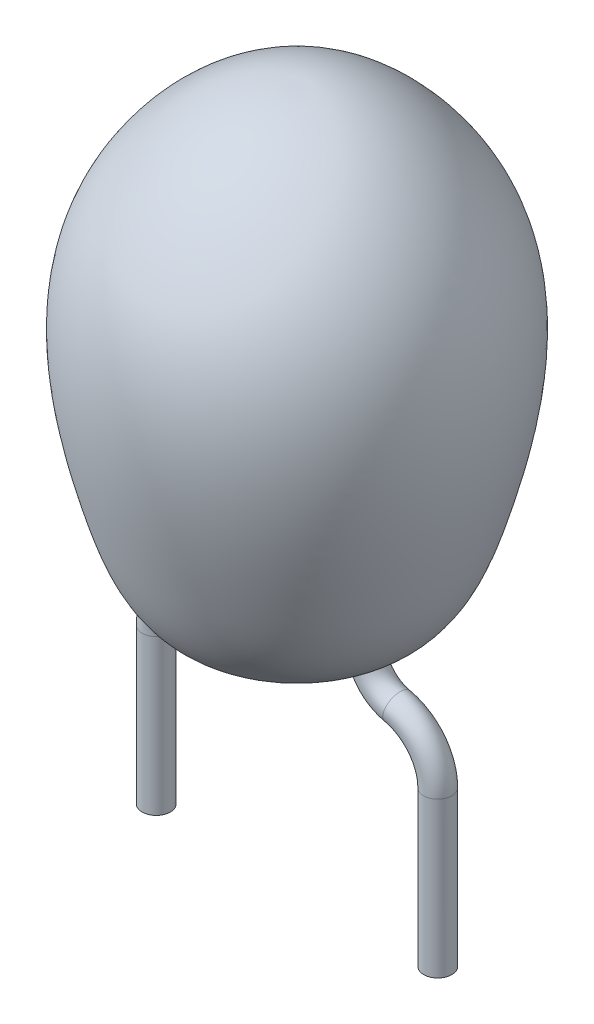
ISO-10303-21;
HEADER;
FILE_DESCRIPTION(('STEP AP214'),'2;1');
FILE_NAME('part.step','',(''),(''),'','','');
FILE_SCHEMA(('AUTOMOTIVE_DESIGN { 1 0 10303 214 1 1 1 1 }'));
ENDSEC;
DATA;
#1=APPLICATION_CONTEXT('core data for automotive mechanical design processes');
#2=APPLICATION_PROTOCOL_DEFINITION('international standard','automotive_design',2000,#1);
#3=PRODUCT_CONTEXT('',#1,'mechanical');
#4=PRODUCT('Part','Part','',(#3));
#5=PRODUCT_RELATED_PRODUCT_CATEGORY('part','',(#4));
#6=PRODUCT_DEFINITION_FORMATION('','',#4);
#7=PRODUCT_DEFINITION_CONTEXT('part definition',#1,'design');
#8=PRODUCT_DEFINITION('design','',#6,#7);
#9=PRODUCT_DEFINITION_SHAPE('','',#8);
#10=(LENGTH_UNIT() NAMED_UNIT(*) SI_UNIT(.MILLI.,.METRE.));
#11=(NAMED_UNIT(*) PLANE_ANGLE_UNIT() SI_UNIT($,.RADIAN.));
#12=(NAMED_UNIT(*) SI_UNIT($,.STERADIAN.) SOLID_ANGLE_UNIT());
#13=UNCERTAINTY_MEASURE_WITH_UNIT(LENGTH_MEASURE(1.E-05),#10,'distance_accuracy_value','');
#14=(GEOMETRIC_REPRESENTATION_CONTEXT(3) GLOBAL_UNCERTAINTY_ASSIGNED_CONTEXT((#13)) GLOBAL_UNIT_ASSIGNED_CONTEXT((#10,
#11,#12)) REPRESENTATION_CONTEXT('',''));
#15=CARTESIAN_POINT('',(0.,0.,0.));
#16=DIRECTION('',(0.,0.,1.));
#17=DIRECTION('',(1.,0.,0.));
#18=AXIS2_PLACEMENT_3D('',#15,#16,#17);
#19=CARTESIAN_POINT('',(2.54,9.97458,0.));
#20=CARTESIAN_POINT('',(2.47974289268972,9.97548804443726,0.));
#21=CARTESIAN_POINT('',(1.39414202398829,9.99184750598306,0.));
#22=CARTESIAN_POINT('',(-1.07872302145443,7.90433195628743,0.));
#23=CARTESIAN_POINT('',(-0.588026500609491,4.51641926353557,0.));
#24=CARTESIAN_POINT('',(0.343357672924847,1.87543708392526,0.));
#25=CARTESIAN_POINT('',(1.53263430059522,1.60072648135662,0.));
#26=CARTESIAN_POINT('',(2.10189668388165,1.50706063448639,0.));
#27=CARTESIAN_POINT('',(2.42633650086462,1.51396214180302,0.));
#28=CARTESIAN_POINT('',(2.53999999999999,1.51637999999999,0.));
#29=B_SPLINE_CURVE_WITH_KNOTS('',3,(#19,#20,#21,#22,#23,#24,#25,#26,#27,#28),.UNSPECIFIED.,.F.,
.F.,(4,1,1,1,1,1,1,4),(0.,0.0154835525893933,0.278953950694581,0.670997062934818,
0.850642039530875,0.916767159551499,0.970840398147402,1.),.UNSPECIFIED.);
#30=CARTESIAN_POINT('',(2.54,11.3856980965108,0.));
#31=DIRECTION('',(0.,1.,0.));
#32=AXIS1_PLACEMENT('',#30,#31);
#33=SURFACE_OF_REVOLUTION('',#29,#32);
#34=CARTESIAN_POINT('',(2.54,9.97458,0.));
#35=VERTEX_POINT('',#34);
#36=VERTEX_LOOP('',#35);
#37=FACE_BOUND('',#36,.T.);
#38=CARTESIAN_POINT('',(2.53999999999999,1.51637999999999,0.));
#39=VERTEX_POINT('',#38);
#40=VERTEX_LOOP('',#39);
#41=FACE_BOUND('',#40,.T.);
#42=CARTESIAN_POINT('',(1.02490235793972,1.74427323908224,0.));
#43=CARTESIAN_POINT('',(1.02490336605588,1.74427289682011,0.0157509381594712));
#44=CARTESIAN_POINT('',(1.0263088078459,1.7438335086506,0.0315052185537073));
#45=CARTESIAN_POINT('',(1.03187237871885,1.74210313979935,0.0624814848905003));
#46=CARTESIAN_POINT('',(1.03603506231303,1.74081075011157,0.0777025461679323));
#47=CARTESIAN_POINT('',(1.05145704219399,1.73606082239147,0.118948011210185));
#48=CARTESIAN_POINT('',(1.06573119812459,1.73169792466758,0.143818882566274));
#49=CARTESIAN_POINT('',(1.10140475122235,1.72106753688358,0.18718027920339));
#50=CARTESIAN_POINT('',(1.1228069129587,1.7147993079307,0.205668323254875));
#51=CARTESIAN_POINT('',(1.17038004895996,1.70126002416138,0.2342275726217));
#52=CARTESIAN_POINT('',(1.1965493616108,1.69398931897698,0.244301703836336));
#53=CARTESIAN_POINT('',(1.25070949858774,1.67933217249043,0.254889655679845));
#54=CARTESIAN_POINT('',(1.27869951340179,1.67194578371714,0.255407696328447));
#55=CARTESIAN_POINT('',(1.33334692356719,1.65778980272431,0.246838769642436));
#56=CARTESIAN_POINT('',(1.36000376858664,1.6510204642897,0.237747869462107));
#57=CARTESIAN_POINT('',(1.40893779554417,1.63868744592926,0.210988586144352));
#58=CARTESIAN_POINT('',(1.43121227387594,1.63312451005235,0.193314931232676));
#59=CARTESIAN_POINT('',(1.46883021304784,1.62371272520938,0.151302596663081));
#60=CARTESIAN_POINT('',(1.48417427243034,1.6198637282202,0.126964492868868));
#61=CARTESIAN_POINT('',(1.50067162703187,1.61570887956735,0.0876796181848498));
#62=CARTESIAN_POINT('',(1.50508647584367,1.61459312383659,0.0740927104931887));
#63=CARTESIAN_POINT('',(1.51164495179295,1.61293368340425,0.0463532159842585));
#64=CARTESIAN_POINT('',(1.51379174144137,1.61238920214269,0.03220144546416));
#65=CARTESIAN_POINT('',(1.51575195318497,1.61189209160177,0.00371183126286482));
#66=CARTESIAN_POINT('',(1.51556233968319,1.61194023229277,-0.0106262303070209));
#67=CARTESIAN_POINT('',(1.51285349837205,1.61262709415498,-0.0390466648696262));
#68=CARTESIAN_POINT('',(1.51033752345638,1.61326499068502,-0.0531293668967632));
#69=CARTESIAN_POINT('',(1.50304447447703,1.61510896742615,-0.0806788767977936));
#70=CARTESIAN_POINT('',(1.49826423498684,1.61631584305504,-0.094144793416661));
#71=CARTESIAN_POINT('',(1.48658444070797,1.61925590959071,-0.120038819068053));
#72=CARTESIAN_POINT('',(1.47968785179127,1.6209883639081,-0.132468349695622));
#73=CARTESIAN_POINT('',(1.46395700468115,1.62493161925125,-0.155974962239724));
#74=CARTESIAN_POINT('',(1.45512003720871,1.62714308904967,-0.167050119091328));
#75=CARTESIAN_POINT('',(1.43578036589726,1.6319813204454,-0.187498749447525));
#76=CARTESIAN_POINT('',(1.42527999802857,1.63460749963598,-0.196874570375981));
#77=CARTESIAN_POINT('',(1.40288691638226,1.64022014700092,-0.21369242706117));
#78=CARTESIAN_POINT('',(1.3909919242103,1.64320720499141,-0.221131232637591));
#79=CARTESIAN_POINT('',(1.36618402838374,1.64946764268679,-0.233834762570047));
#80=CARTESIAN_POINT('',(1.35327256734075,1.65274061730657,-0.239102504222151));
#81=CARTESIAN_POINT('',(1.32676524023766,1.65951108089259,-0.247337021269825));
#82=CARTESIAN_POINT('',(1.3131682229366,1.66300895042688,-0.250299778968753));
#83=CARTESIAN_POINT('',(1.28572172315192,1.67013940947337,-0.25382213358671));
#84=CARTESIAN_POINT('',(1.27187262103764,1.67377180338849,-0.254385091332288));
#85=CARTESIAN_POINT('',(1.2442850186388,1.68109094932935,-0.253099862323733));
#86=CARTESIAN_POINT('',(1.23054665395539,1.68477775582421,-0.25124907091839));
#87=CARTESIAN_POINT('',(1.20360732880656,1.69209723825854,-0.245188198550053));
#88=CARTESIAN_POINT('',(1.19040564309993,1.69572998273731,-0.24098142328405));
#89=CARTESIAN_POINT('',(1.16488356878557,1.70284152783675,-0.230326103310917));
#90=CARTESIAN_POINT('',(1.15256382907432,1.70632021440521,-0.223875928041898));
#91=CARTESIAN_POINT('',(1.12917898351456,1.71300294654217,-0.20892828498787));
#92=CARTESIAN_POINT('',(1.11811215485272,1.71620736772134,-0.200433679929219));
#93=CARTESIAN_POINT('',(1.09750530924031,1.72223873595844,-0.181619377393251));
#94=CARTESIAN_POINT('',(1.08796754875771,1.72506512414749,-0.171297029078038));
#95=CARTESIAN_POINT('',(1.07071360874071,1.73022446861118,-0.149144496898906));
#96=CARTESIAN_POINT('',(1.06299491454275,1.73255810559125,-0.137316429806621));
#97=CARTESIAN_POINT('',(1.0495587494987,1.73664812199407,-0.112450159823206));
#98=CARTESIAN_POINT('',(1.04384540629867,1.73840331033889,-0.0994095300325753));
#99=CARTESIAN_POINT('',(1.03460546580502,1.74125410618617,-0.0725308699684236));
#100=CARTESIAN_POINT('',(1.03107545759152,1.74235074243473,-0.0586941205925307));
#101=CARTESIAN_POINT('',(1.02616761482125,1.74387775331988,-0.029919878701252));
#102=CARTESIAN_POINT('',(1.02490140035379,1.74427356418902,-0.0149614471421896));
#103=CARTESIAN_POINT('',(1.02490235793972,1.74427323908224,0.));
#104=B_SPLINE_CURVE_WITH_KNOTS('',3,(#42,#43,#44,#45,#46,#47,#48,#49,#50,#51,#52,#53,#54,#55,
#56,#57,#58,#59,#60,#61,#62,#63,#64,#65,#66,#67,#68,#69,#70,#71,#72,#73,#74,#75,#76,#77,#78,#79,
#80,#81,#82,#83,#84,#85,#86,#87,#88,#89,#90,#91,#92,#93,#94,#95,#96,#97,#98,#99,#100,#101,#102,
#103),.UNSPECIFIED.,.T.,.F.,(4,2,2,2,2,2,2,2,2,2,2,2,2,2,2,2,2,2,2,2,2,2,2,2,2,2,2,2,2,2,4),(0.,
0.0471846793615346,0.0944474950975439,0.179710590268481,0.265006792982135,0.350273321971121,
0.435502195911697,0.520765966711329,0.606082175333539,0.691391014252125,0.734211456477834,
0.77697211209238,0.819788330800927,0.862544771038316,0.905361161703,0.948117820999726,
0.990934563828189,1.03369170214827,1.07651969243187,1.11928795897296,1.16213060664811,
1.20491323510845,1.24774206807182,1.29051095762222,1.33331099790834,1.37605145231299,
1.41885441010703,1.46159784570436,1.50442875185921,1.54719257519853,1.59201219667385),.UNSPECIFIED.);
#105=CARTESIAN_POINT('',(1.02490235793972,1.74427323908224,0.));
#106=VERTEX_POINT('',#105);
#107=EDGE_CURVE('E11',#106,#106,#104,.T.);
#108=ORIENTED_EDGE('',*,*,#107,.T.);
#109=EDGE_LOOP('',(#108));
#110=FACE_BOUND('',#109,.T.);
#111=CARTESIAN_POINT('',(4.05509764206028,1.74427323908224,0.));
#112=CARTESIAN_POINT('',(4.05509663394412,1.74427289682011,-0.0157509381594712));
#113=CARTESIAN_POINT('',(4.0536911921541,1.7438335086506,-0.0315052185537073));
#114=CARTESIAN_POINT('',(4.04812762128115,1.74210313979935,-0.0624814848905002));
#115=CARTESIAN_POINT('',(4.04396493768697,1.74081075011157,-0.077702546167932));
#116=CARTESIAN_POINT('',(4.028542957806,1.73606082239147,-0.118948011210185));
#117=CARTESIAN_POINT('',(4.01426880187541,1.73169792466758,-0.143818882566274));
#118=CARTESIAN_POINT('',(3.97859524877765,1.72106753688358,-0.187180279203389));
#119=CARTESIAN_POINT('',(3.95719308704129,1.7147993079307,-0.205668323254874));
#120=CARTESIAN_POINT('',(3.90961995104004,1.70126002416138,-0.2342275726217));
#121=CARTESIAN_POINT('',(3.8834506383892,1.69398931897698,-0.244301703836337));
#122=CARTESIAN_POINT('',(3.82929050141226,1.67933217249043,-0.254889655679845));
#123=CARTESIAN_POINT('',(3.80130048659821,1.67194578371714,-0.255407696328446));
#124=CARTESIAN_POINT('',(3.74665307643281,1.65778980272431,-0.246838769642435));
#125=CARTESIAN_POINT('',(3.71999623141336,1.6510204642897,-0.237747869462107));
#126=CARTESIAN_POINT('',(3.67106220445583,1.63868744592926,-0.210988586144351));
#127=CARTESIAN_POINT('',(3.64878772612406,1.63312451005235,-0.193314931232676));
#128=CARTESIAN_POINT('',(3.61116978695216,1.62371272520938,-0.151302596663081));
#129=CARTESIAN_POINT('',(3.59582572756966,1.6198637282202,-0.126964492868868));
#130=CARTESIAN_POINT('',(3.57932837296813,1.61570887956735,-0.0876796181848498));
#131=CARTESIAN_POINT('',(3.57491352415633,1.61459312383659,-0.0740927104931889));
#132=CARTESIAN_POINT('',(3.56835504820705,1.61293368340425,-0.0463532159842587));
#133=CARTESIAN_POINT('',(3.56620825855863,1.61238920214269,-0.0322014454641599));
#134=CARTESIAN_POINT('',(3.56424804681503,1.61189209160177,-0.00371183126286455));
#135=CARTESIAN_POINT('',(3.56443766031681,1.61194023229277,0.0106262303070213));
#136=CARTESIAN_POINT('',(3.56714650162795,1.61262709415498,0.0390466648696266));
#137=CARTESIAN_POINT('',(3.56966247654362,1.61326499068502,0.0531293668967635));
#138=CARTESIAN_POINT('',(3.57695552552297,1.61510896742615,0.0806788767977938));
#139=CARTESIAN_POINT('',(3.58173576501316,1.61631584305504,0.0941447934166612));
#140=CARTESIAN_POINT('',(3.59341555929203,1.61925590959071,0.120038819068053));
#141=CARTESIAN_POINT('',(3.60031214820873,1.6209883639081,0.132468349695622));
#142=CARTESIAN_POINT('',(3.61604299531885,1.62493161925125,0.155974962239724));
#143=CARTESIAN_POINT('',(3.62487996279129,1.62714308904967,0.167050119091328));
#144=CARTESIAN_POINT('',(3.64421963410274,1.6319813204454,0.187498749447525));
#145=CARTESIAN_POINT('',(3.65472000197143,1.63460749963598,0.196874570375981));
#146=CARTESIAN_POINT('',(3.67711308361774,1.64022014700093,0.21369242706117));
#147=CARTESIAN_POINT('',(3.6890080757897,1.64320720499141,0.221131232637591));
#148=CARTESIAN_POINT('',(3.71381597161626,1.64946764268679,0.233834762570048));
#149=CARTESIAN_POINT('',(3.72672743265925,1.65274061730657,0.239102504222152));
#150=CARTESIAN_POINT('',(3.75323475976234,1.65951108089259,0.247337021269825));
#151=CARTESIAN_POINT('',(3.7668317770634,1.66300895042688,0.250299778968753));
#152=CARTESIAN_POINT('',(3.79427827684808,1.67013940947337,0.25382213358671));
#153=CARTESIAN_POINT('',(3.80812737896236,1.67377180338849,0.254385091332289));
#154=CARTESIAN_POINT('',(3.8357149813612,1.68109094932935,0.253099862323733));
#155=CARTESIAN_POINT('',(3.84945334604461,1.68477775582421,0.25124907091839));
#156=CARTESIAN_POINT('',(3.87639267119344,1.69209723825854,0.245188198550053));
#157=CARTESIAN_POINT('',(3.88959435690007,1.69572998273731,0.240981423284051));
#158=CARTESIAN_POINT('',(3.91511643121442,1.70284152783675,0.230326103310918));
#159=CARTESIAN_POINT('',(3.92743617092568,1.70632021440521,0.223875928041898));
#160=CARTESIAN_POINT('',(3.95082101648544,1.71300294654217,0.20892828498787));
#161=CARTESIAN_POINT('',(3.96188784514728,1.71620736772134,0.20043367992922));
#162=CARTESIAN_POINT('',(3.98249469075969,1.72223873595844,0.181619377393252));
#163=CARTESIAN_POINT('',(3.99203245124229,1.72506512414749,0.171297029078037));
#164=CARTESIAN_POINT('',(4.00928639125929,1.73022446861118,0.149144496898906));
#165=CARTESIAN_POINT('',(4.01700508545725,1.73255810559125,0.137316429806622));
#166=CARTESIAN_POINT('',(4.0304412505013,1.73664812199407,0.112450159823207));
#167=CARTESIAN_POINT('',(4.03615459370133,1.73840331033889,0.0994095300325756));
#168=CARTESIAN_POINT('',(4.04539453419498,1.74125410618616,0.0725308699684235));
#169=CARTESIAN_POINT('',(4.04892454240848,1.74235074243473,0.0586941205925306));
#170=CARTESIAN_POINT('',(4.05383238517875,1.74387775331988,0.0299198787012521));
#171=CARTESIAN_POINT('',(4.05509859964621,1.74427356418902,0.0149614471421896));
#172=CARTESIAN_POINT('',(4.05509764206028,1.74427323908224,0.));
#173=B_SPLINE_CURVE_WITH_KNOTS('',3,(#111,#112,#113,#114,#115,#116,#117,#118,#119,#120,#121,
#122,#123,#124,#125,#126,#127,#128,#129,#130,#131,#132,#133,#134,#135,#136,#137,#138,#139,#140,
#141,#142,#143,#144,#145,#146,#147,#148,#149,#150,#151,#152,#153,#154,#155,#156,#157,#158,#159,
#160,#161,#162,#163,#164,#165,#166,#167,#168,#169,#170,#171,#172),.UNSPECIFIED.,.T.,.F.,(4,2,2,
2,2,2,2,2,2,2,2,2,2,2,2,2,2,2,2,2,2,2,2,2,2,2,2,2,2,2,4),(0.,0.0471846793615345,
0.0944474950975441,0.179710590268481,0.265006792982134,0.35027332197112,0.435502195911697,
0.520765966711328,0.606082175333539,0.691391014252125,0.734211456477833,0.776972112092379,
0.819788330800926,0.862544771038315,0.905361161702999,0.948117820999725,0.990934563828189,
1.03369170214827,1.07651969243187,1.11928795897296,1.16213060664811,1.20491323510845,
1.24774206807182,1.29051095762222,1.33331099790833,1.37605145231299,1.41885441010703,
1.46159784570436,1.50442875185921,1.54719257519853,1.59201219667385),.UNSPECIFIED.);
#174=CARTESIAN_POINT('',(4.05509764206028,1.74427323908224,0.));
#175=VERTEX_POINT('',#174);
#176=EDGE_CURVE('E36',#175,#175,#173,.T.);
#177=ORIENTED_EDGE('',*,*,#176,.T.);
#178=EDGE_LOOP('',(#177));
#179=FACE_BOUND('',#178,.T.);
#180=ADVANCED_FACE('F31',(#37,#41,#110,#179),#33,.F.);
#181=CARTESIAN_POINT('',(0.57783422143837,1.869694,0.));
#182=DIRECTION('',(0.,0.,1.));
#183=DIRECTION('',(1.,0.,0.));
#184=AXIS2_PLACEMENT_3D('',#181,#182,#183);
#185=TOROIDAL_SURFACE('',#184,0.71832777856163,0.254);
#186=ORIENTED_EDGE('',*,*,#107,.F.);
#187=EDGE_LOOP('',(#186));
#188=FACE_BOUND('',#187,.T.);
#189=CARTESIAN_POINT('',(0.733609558615477,1.16846020034353,0.));
#190=DIRECTION('',(0.976203093608056,0.21685829481498,0.));
#191=DIRECTION('',(0.,0.,1.));
#192=AXIS2_PLACEMENT_3D('',#189,#190,#191);
#193=CIRCLE('',#192,0.254);
#194=CARTESIAN_POINT('',(0.678527551732473,1.41641578611998,0.));
#195=VERTEX_POINT('',#194);
#196=EDGE_CURVE('E45',#195,#195,#193,.T.);
#197=ORIENTED_EDGE('',*,*,#196,.T.);
#198=EDGE_LOOP('',(#197));
#199=FACE_BOUND('',#198,.T.);
#200=ADVANCED_FACE('F33',(#188,#199),#185,.T.);
#201=CARTESIAN_POINT('',(0.936752,0.254,0.));
#202=DIRECTION('',(0.,0.,-1.));
#203=DIRECTION('',(-1.,0.,0.));
#204=AXIS2_PLACEMENT_3D('',#201,#202,#203);
#205=TOROIDAL_SURFACE('',#204,0.936752,0.254);
#206=CARTESIAN_POINT('',(0.,0.254,0.));
#207=DIRECTION('',(0.,1.,0.));
#208=DIRECTION('',(0.,0.,1.));
#209=AXIS2_PLACEMENT_3D('',#206,#207,#208);
#210=CIRCLE('',#209,0.254);
#211=CARTESIAN_POINT('',(-0.254,0.254,0.));
#212=VERTEX_POINT('',#211);
#213=EDGE_CURVE('E61',#212,#212,#210,.T.);
#214=CARTESIAN_POINT('',(0.936752,0.254,0.));
#215=DIRECTION('',(0.,0.,-1.));
#216=DIRECTION('',(-1.,0.,0.));
#217=AXIS2_PLACEMENT_3D('',#214,#215,#216);
#218=CIRCLE('',#217,1.190752);
#219=EDGE_CURVE('',#212,#195,#218,.T.);
#220=ORIENTED_EDGE('',*,*,#213,.T.);
#221=ORIENTED_EDGE('',*,*,#196,.F.);
#222=ORIENTED_EDGE('',*,*,#219,.T.);
#223=ORIENTED_EDGE('',*,*,#219,.F.);
#224=EDGE_LOOP('',(#220,#222,#221,#223));
#225=FACE_BOUND('',#224,.T.);
#226=ADVANCED_FACE('F97',(#225),#205,.T.);
#227=CARTESIAN_POINT('',(0.,0.254,0.));
#228=DIRECTION('',(0.,-1.,0.));
#229=DIRECTION('',(1.,0.,0.));
#230=AXIS2_PLACEMENT_3D('',#227,#228,#229);
#231=CYLINDRICAL_SURFACE('',#230,0.254);
#232=ORIENTED_EDGE('',*,*,#213,.F.);
#233=EDGE_LOOP('',(#232));
#234=FACE_BOUND('',#233,.T.);
#235=CARTESIAN_POINT('',(0.,-2.54,0.));
#236=DIRECTION('',(0.,1.,0.));
#237=DIRECTION('',(0.,0.,1.));
#238=AXIS2_PLACEMENT_3D('',#235,#236,#237);
#239=CIRCLE('',#238,0.254);
#240=CARTESIAN_POINT('',(0.,-2.54,0.254));
#241=VERTEX_POINT('',#240);
#242=EDGE_CURVE('E58',#241,#241,#239,.T.);
#243=ORIENTED_EDGE('',*,*,#242,.T.);
#244=EDGE_LOOP('',(#243));
#245=FACE_BOUND('',#244,.T.);
#246=ADVANCED_FACE('F100',(#234,#245),#231,.T.);
#247=CARTESIAN_POINT('',(0.,-2.54,0.));
#248=DIRECTION('',(0.,1.,0.));
#249=DIRECTION('',(0.,0.,1.));
#250=AXIS2_PLACEMENT_3D('',#247,#248,#249);
#251=PLANE('',#250);
#252=ORIENTED_EDGE('',*,*,#242,.F.);
#253=EDGE_LOOP('',(#252));
#254=FACE_BOUND('',#253,.T.);
#255=ADVANCED_FACE('F85',(#254),#251,.F.);
#256=CARTESIAN_POINT('',(4.50216577856163,1.869694,0.));
#257=DIRECTION('',(0.,0.,-1.));
#258=DIRECTION('',(-1.,0.,0.));
#259=AXIS2_PLACEMENT_3D('',#256,#257,#258);
#260=TOROIDAL_SURFACE('',#259,0.71832777856163,0.254);
#261=ORIENTED_EDGE('',*,*,#176,.F.);
#262=EDGE_LOOP('',(#261));
#263=FACE_BOUND('',#262,.T.);
#264=CARTESIAN_POINT('',(4.34639044138452,1.16846020034353,0.));
#265=DIRECTION('',(0.976203093608056,-0.216858294814979,0.));
#266=DIRECTION('',(0.,0.,1.));
#267=AXIS2_PLACEMENT_3D('',#264,#265,#266);
#268=CIRCLE('',#267,0.254);
#269=CARTESIAN_POINT('',(4.40147244826753,1.41641578611998,0.));
#270=VERTEX_POINT('',#269);
#271=EDGE_CURVE('E59',#270,#270,#268,.T.);
#272=ORIENTED_EDGE('',*,*,#271,.F.);
#273=EDGE_LOOP('',(#272));
#274=FACE_BOUND('',#273,.T.);
#275=ADVANCED_FACE('F82',(#263,#274),#260,.T.);
#276=CARTESIAN_POINT('',(4.143248,0.254,0.));
#277=DIRECTION('',(0.,0.,1.));
#278=DIRECTION('',(1.,0.,0.));
#279=AXIS2_PLACEMENT_3D('',#276,#277,#278);
#280=TOROIDAL_SURFACE('',#279,0.936752,0.254);
#281=CARTESIAN_POINT('',(5.08,0.254,0.));
#282=DIRECTION('',(0.,-1.,0.));
#283=DIRECTION('',(0.,0.,1.));
#284=AXIS2_PLACEMENT_3D('',#281,#282,#283);
#285=CIRCLE('',#284,0.254);
#286=CARTESIAN_POINT('',(5.334,0.254,0.));
#287=VERTEX_POINT('',#286);
#288=EDGE_CURVE('E64',#287,#287,#285,.T.);
#289=CARTESIAN_POINT('',(4.143248,0.254,0.));
#290=DIRECTION('',(0.,0.,1.));
#291=DIRECTION('',(1.,0.,0.));
#292=AXIS2_PLACEMENT_3D('',#289,#290,#291);
#293=CIRCLE('',#292,1.190752);
#294=EDGE_CURVE('',#287,#270,#293,.T.);
#295=ORIENTED_EDGE('',*,*,#288,.F.);
#296=ORIENTED_EDGE('',*,*,#271,.T.);
#297=ORIENTED_EDGE('',*,*,#294,.T.);
#298=ORIENTED_EDGE('',*,*,#294,.F.);
#299=EDGE_LOOP('',(#295,#297,#296,#298));
#300=FACE_BOUND('',#299,.T.);
#301=ADVANCED_FACE('F109',(#300),#280,.T.);
#302=CARTESIAN_POINT('',(5.08,0.254,0.));
#303=DIRECTION('',(0.,-1.,0.));
#304=DIRECTION('',(0.,0.,-1.));
#305=AXIS2_PLACEMENT_3D('',#302,#303,#304);
#306=CYLINDRICAL_SURFACE('',#305,0.254);
#307=ORIENTED_EDGE('',*,*,#288,.T.);
#308=EDGE_LOOP('',(#307));
#309=FACE_BOUND('',#308,.T.);
#310=CARTESIAN_POINT('',(5.08,-2.54,0.));
#311=DIRECTION('',(0.,-1.,0.));
#312=DIRECTION('',(0.,0.,1.));
#313=AXIS2_PLACEMENT_3D('',#310,#311,#312);
#314=CIRCLE('',#313,0.254);
#315=CARTESIAN_POINT('',(5.08,-2.54,0.254));
#316=VERTEX_POINT('',#315);
#317=EDGE_CURVE('E69',#316,#316,#314,.T.);
#318=ORIENTED_EDGE('',*,*,#317,.F.);
#319=EDGE_LOOP('',(#318));
#320=FACE_BOUND('',#319,.T.);
#321=ADVANCED_FACE('F113',(#309,#320),#306,.T.);
#322=CARTESIAN_POINT('',(5.08,-2.54,0.));
#323=DIRECTION('',(0.,1.,0.));
#324=DIRECTION('',(0.,0.,1.));
#325=AXIS2_PLACEMENT_3D('',#322,#323,#324);
#326=PLANE('',#325);
#327=ORIENTED_EDGE('',*,*,#317,.T.);
#328=EDGE_LOOP('',(#327));
#329=FACE_BOUND('',#328,.T.);
#330=ADVANCED_FACE('F119',(#329),#326,.F.);
#331=CLOSED_SHELL('',(#180,#200,#226,#246,#255,#275,#301,#321,#330));
#332=MANIFOLD_SOLID_BREP('B2',#331);
#333=ADVANCED_BREP_SHAPE_REPRESENTATION('',(#18,#332),#14);
#334=SHAPE_DEFINITION_REPRESENTATION(#9,#333);
ENDSEC;
END-ISO-10303-21;
